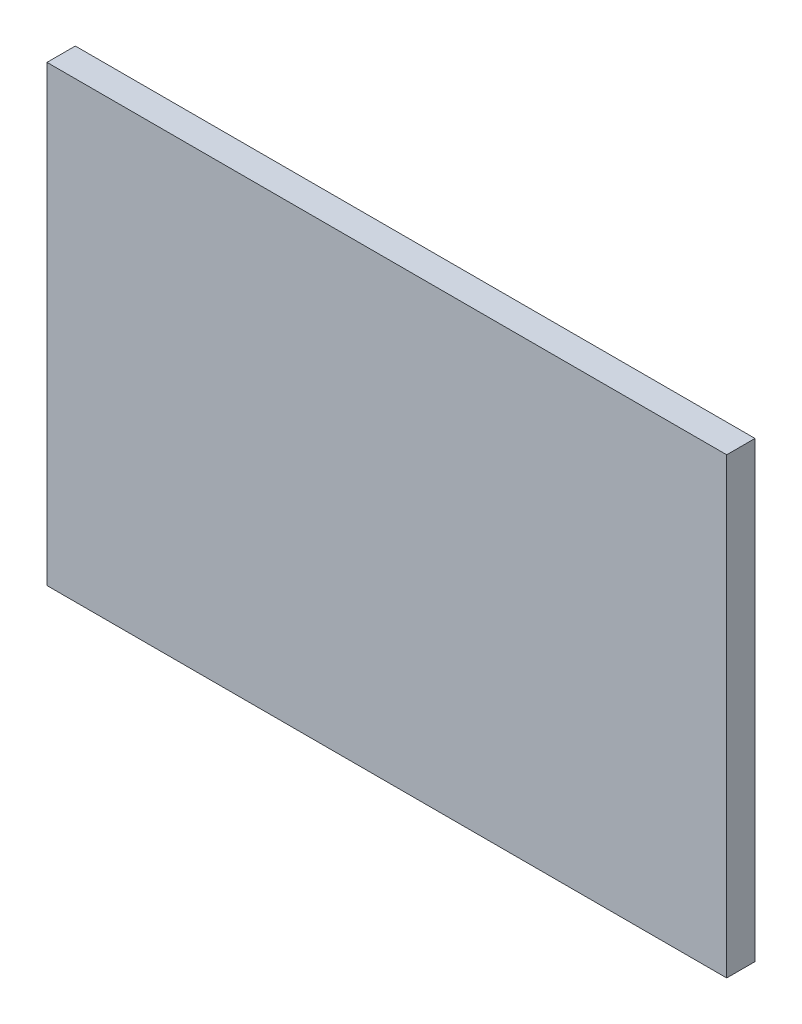
ISO-10303-21;
HEADER;
FILE_DESCRIPTION(('STEP AP214'),'2;1');
FILE_NAME('part.step','',(''),(''),'','','');
FILE_SCHEMA(('AUTOMOTIVE_DESIGN { 1 0 10303 214 1 1 1 1 }'));
ENDSEC;
DATA;
#1=APPLICATION_CONTEXT('core data for automotive mechanical design processes');
#2=APPLICATION_PROTOCOL_DEFINITION('international standard','automotive_design',2000,#1);
#3=PRODUCT_CONTEXT('',#1,'mechanical');
#4=PRODUCT('Part','Part','',(#3));
#5=PRODUCT_RELATED_PRODUCT_CATEGORY('part','',(#4));
#6=PRODUCT_DEFINITION_FORMATION('','',#4);
#7=PRODUCT_DEFINITION_CONTEXT('part definition',#1,'design');
#8=PRODUCT_DEFINITION('design','',#6,#7);
#9=PRODUCT_DEFINITION_SHAPE('','',#8);
#10=(LENGTH_UNIT() NAMED_UNIT(*) SI_UNIT(.MILLI.,.METRE.));
#11=(NAMED_UNIT(*) PLANE_ANGLE_UNIT() SI_UNIT($,.RADIAN.));
#12=(NAMED_UNIT(*) SI_UNIT($,.STERADIAN.) SOLID_ANGLE_UNIT());
#13=UNCERTAINTY_MEASURE_WITH_UNIT(LENGTH_MEASURE(1.E-05),#10,'distance_accuracy_value','');
#14=(GEOMETRIC_REPRESENTATION_CONTEXT(3) GLOBAL_UNCERTAINTY_ASSIGNED_CONTEXT((#13)) GLOBAL_UNIT_ASSIGNED_CONTEXT((#10,
#11,#12)) REPRESENTATION_CONTEXT('',''));
#15=CARTESIAN_POINT('',(0.,0.,0.));
#16=DIRECTION('',(0.,0.,1.));
#17=DIRECTION('',(1.,0.,0.));
#18=AXIS2_PLACEMENT_3D('',#15,#16,#17);
#19=CARTESIAN_POINT('',(76.2,-50.8,6.35));
#20=DIRECTION('',(-1.,0.,0.));
#21=DIRECTION('',(0.,0.,1.));
#22=AXIS2_PLACEMENT_3D('',#19,#20,#21);
#23=PLANE('',#22);
#24=DIRECTION('',(0.,1.,0.));
#25=VECTOR('',#24,1.);
#26=CARTESIAN_POINT('',(76.2,-50.8,0.));
#27=LINE('',#26,#25);
#28=CARTESIAN_POINT('',(76.2,-50.8,0.));
#29=VERTEX_POINT('',#28);
#30=CARTESIAN_POINT('',(76.2,50.8,0.));
#31=VERTEX_POINT('',#30);
#32=EDGE_CURVE('E116',#29,#31,#27,.T.);
#33=ORIENTED_EDGE('',*,*,#32,.T.);
#34=DIRECTION('',(0.,0.,-1.));
#35=VECTOR('',#34,1.);
#36=CARTESIAN_POINT('',(76.2,50.8,6.35));
#37=LINE('',#36,#35);
#38=CARTESIAN_POINT('',(76.2,50.8,6.35));
#39=VERTEX_POINT('',#38);
#40=EDGE_CURVE('E11',#39,#31,#37,.T.);
#41=ORIENTED_EDGE('',*,*,#40,.F.);
#42=DIRECTION('',(0.,1.,0.));
#43=VECTOR('',#42,1.);
#44=CARTESIAN_POINT('',(76.2,-50.8,6.35));
#45=LINE('',#44,#43);
#46=CARTESIAN_POINT('',(76.2,-50.8,6.35));
#47=VERTEX_POINT('',#46);
#48=EDGE_CURVE('E98',#47,#39,#45,.T.);
#49=ORIENTED_EDGE('',*,*,#48,.F.);
#50=DIRECTION('',(0.,0.,-1.));
#51=VECTOR('',#50,1.);
#52=CARTESIAN_POINT('',(76.2,-50.8,6.35));
#53=LINE('',#52,#51);
#54=EDGE_CURVE('E112',#47,#29,#53,.T.);
#55=ORIENTED_EDGE('',*,*,#54,.T.);
#56=EDGE_LOOP('',(#33,#41,#49,#55));
#57=FACE_BOUND('',#56,.T.);
#58=ADVANCED_FACE('F38',(#57),#23,.F.);
#59=CARTESIAN_POINT('',(-76.2,50.8,6.35));
#60=DIRECTION('',(0.,-1.,0.));
#61=DIRECTION('',(0.,0.,-1.));
#62=AXIS2_PLACEMENT_3D('',#59,#60,#61);
#63=PLANE('',#62);
#64=DIRECTION('',(-1.,0.,0.));
#65=VECTOR('',#64,1.);
#66=CARTESIAN_POINT('',(-76.2,50.8,0.));
#67=LINE('',#66,#65);
#68=CARTESIAN_POINT('',(-76.2,50.8,0.));
#69=VERTEX_POINT('',#68);
#70=EDGE_CURVE('E103',#31,#69,#67,.T.);
#71=ORIENTED_EDGE('',*,*,#70,.T.);
#72=DIRECTION('',(0.,0.,-1.));
#73=VECTOR('',#72,1.);
#74=CARTESIAN_POINT('',(-76.2,50.8,6.35));
#75=LINE('',#74,#73);
#76=CARTESIAN_POINT('',(-76.2,50.8,6.35));
#77=VERTEX_POINT('',#76);
#78=EDGE_CURVE('E47',#77,#69,#75,.T.);
#79=ORIENTED_EDGE('',*,*,#78,.F.);
#80=DIRECTION('',(-1.,0.,0.));
#81=VECTOR('',#80,1.);
#82=CARTESIAN_POINT('',(-76.2,50.8,6.35));
#83=LINE('',#82,#81);
#84=EDGE_CURVE('E93',#39,#77,#83,.T.);
#85=ORIENTED_EDGE('',*,*,#84,.F.);
#86=ORIENTED_EDGE('',*,*,#40,.T.);
#87=EDGE_LOOP('',(#71,#79,#85,#86));
#88=FACE_BOUND('',#87,.T.);
#89=ADVANCED_FACE('F102',(#88),#63,.F.);
#90=CARTESIAN_POINT('',(-76.2,-50.8,6.35));
#91=DIRECTION('',(1.,0.,0.));
#92=DIRECTION('',(0.,0.,-1.));
#93=AXIS2_PLACEMENT_3D('',#90,#91,#92);
#94=PLANE('',#93);
#95=DIRECTION('',(0.,-1.,0.));
#96=VECTOR('',#95,1.);
#97=CARTESIAN_POINT('',(-76.2,-50.8,0.));
#98=LINE('',#97,#96);
#99=CARTESIAN_POINT('',(-76.2,-50.8,0.));
#100=VERTEX_POINT('',#99);
#101=EDGE_CURVE('E78',#69,#100,#98,.T.);
#102=ORIENTED_EDGE('',*,*,#101,.T.);
#103=DIRECTION('',(0.,0.,-1.));
#104=VECTOR('',#103,1.);
#105=CARTESIAN_POINT('',(-76.2,-50.8,6.35));
#106=LINE('',#105,#104);
#107=CARTESIAN_POINT('',(-76.2,-50.8,6.35));
#108=VERTEX_POINT('',#107);
#109=EDGE_CURVE('E105',#108,#100,#106,.T.);
#110=ORIENTED_EDGE('',*,*,#109,.F.);
#111=DIRECTION('',(0.,-1.,0.));
#112=VECTOR('',#111,1.);
#113=CARTESIAN_POINT('',(-76.2,-50.8,6.35));
#114=LINE('',#113,#112);
#115=EDGE_CURVE('E96',#77,#108,#114,.T.);
#116=ORIENTED_EDGE('',*,*,#115,.F.);
#117=ORIENTED_EDGE('',*,*,#78,.T.);
#118=EDGE_LOOP('',(#102,#110,#116,#117));
#119=FACE_BOUND('',#118,.T.);
#120=ADVANCED_FACE('F106',(#119),#94,.F.);
#121=CARTESIAN_POINT('',(-76.2,-50.8,6.35));
#122=DIRECTION('',(0.,1.,0.));
#123=DIRECTION('',(0.,0.,1.));
#124=AXIS2_PLACEMENT_3D('',#121,#122,#123);
#125=PLANE('',#124);
#126=DIRECTION('',(1.,0.,0.));
#127=VECTOR('',#126,1.);
#128=CARTESIAN_POINT('',(-76.2,-50.8,0.));
#129=LINE('',#128,#127);
#130=EDGE_CURVE('E85',#100,#29,#129,.T.);
#131=ORIENTED_EDGE('',*,*,#130,.T.);
#132=ORIENTED_EDGE('',*,*,#54,.F.);
#133=DIRECTION('',(1.,0.,0.));
#134=VECTOR('',#133,1.);
#135=CARTESIAN_POINT('',(-76.2,-50.8,6.35));
#136=LINE('',#135,#134);
#137=EDGE_CURVE('E58',#108,#47,#136,.T.);
#138=ORIENTED_EDGE('',*,*,#137,.F.);
#139=ORIENTED_EDGE('',*,*,#109,.T.);
#140=EDGE_LOOP('',(#131,#132,#138,#139));
#141=FACE_BOUND('',#140,.T.);
#142=ADVANCED_FACE('F127',(#141),#125,.F.);
#143=CARTESIAN_POINT('',(0.,0.,6.35));
#144=DIRECTION('',(0.,0.,-1.));
#145=DIRECTION('',(-1.,0.,0.));
#146=AXIS2_PLACEMENT_3D('',#143,#144,#145);
#147=PLANE('',#146);
#148=ORIENTED_EDGE('',*,*,#48,.T.);
#149=ORIENTED_EDGE('',*,*,#84,.T.);
#150=ORIENTED_EDGE('',*,*,#115,.T.);
#151=ORIENTED_EDGE('',*,*,#137,.T.);
#152=EDGE_LOOP('',(#148,#149,#150,#151));
#153=FACE_BOUND('',#152,.T.);
#154=ADVANCED_FACE('F94',(#153),#147,.F.);
#155=CARTESIAN_POINT('',(0.,0.,0.));
#156=DIRECTION('',(0.,0.,-1.));
#157=DIRECTION('',(-1.,0.,0.));
#158=AXIS2_PLACEMENT_3D('',#155,#156,#157);
#159=PLANE('',#158);
#160=ORIENTED_EDGE('',*,*,#32,.F.);
#161=ORIENTED_EDGE('',*,*,#130,.F.);
#162=ORIENTED_EDGE('',*,*,#101,.F.);
#163=ORIENTED_EDGE('',*,*,#70,.F.);
#164=EDGE_LOOP('',(#160,#161,#162,#163));
#165=FACE_BOUND('',#164,.T.);
#166=ADVANCED_FACE('F130',(#165),#159,.T.);
#167=CLOSED_SHELL('',(#58,#89,#120,#142,#154,#166));
#168=MANIFOLD_SOLID_BREP('B2',#167);
#169=ADVANCED_BREP_SHAPE_REPRESENTATION('',(#18,#168),#14);
#170=SHAPE_DEFINITION_REPRESENTATION(#9,#169);
ENDSEC;
END-ISO-10303-21;
